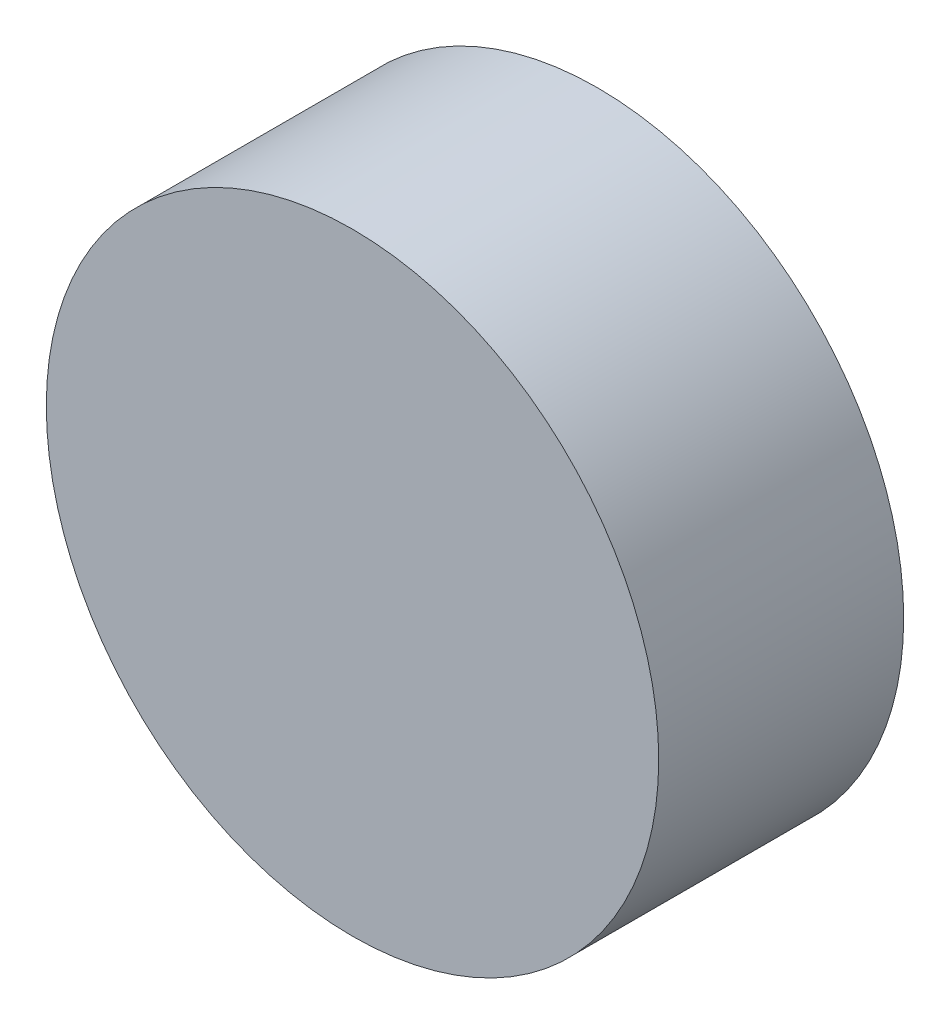
ISO-10303-21;
HEADER;
FILE_DESCRIPTION(('STEP AP214'),'2;1');
FILE_NAME('part.step','',(''),(''),'','','');
FILE_SCHEMA(('AUTOMOTIVE_DESIGN { 1 0 10303 214 1 1 1 1 }'));
ENDSEC;
DATA;
#1=APPLICATION_CONTEXT('core data for automotive mechanical design processes');
#2=APPLICATION_PROTOCOL_DEFINITION('international standard','automotive_design',2000,#1);
#3=PRODUCT_CONTEXT('',#1,'mechanical');
#4=PRODUCT('Part','Part','',(#3));
#5=PRODUCT_RELATED_PRODUCT_CATEGORY('part','',(#4));
#6=PRODUCT_DEFINITION_FORMATION('','',#4);
#7=PRODUCT_DEFINITION_CONTEXT('part definition',#1,'design');
#8=PRODUCT_DEFINITION('design','',#6,#7);
#9=PRODUCT_DEFINITION_SHAPE('','',#8);
#10=(LENGTH_UNIT() NAMED_UNIT(*) SI_UNIT(.MILLI.,.METRE.));
#11=(NAMED_UNIT(*) PLANE_ANGLE_UNIT() SI_UNIT($,.RADIAN.));
#12=(NAMED_UNIT(*) SI_UNIT($,.STERADIAN.) SOLID_ANGLE_UNIT());
#13=UNCERTAINTY_MEASURE_WITH_UNIT(LENGTH_MEASURE(1.E-05),#10,'distance_accuracy_value','');
#14=(GEOMETRIC_REPRESENTATION_CONTEXT(3) GLOBAL_UNCERTAINTY_ASSIGNED_CONTEXT((#13)) GLOBAL_UNIT_ASSIGNED_CONTEXT((#10,
#11,#12)) REPRESENTATION_CONTEXT('',''));
#15=CARTESIAN_POINT('',(0.,0.,0.));
#16=DIRECTION('',(0.,0.,1.));
#17=DIRECTION('',(1.,0.,0.));
#18=AXIS2_PLACEMENT_3D('',#15,#16,#17);
#19=CARTESIAN_POINT('',(0.,0.,2.));
#20=DIRECTION('',(0.,0.,-1.));
#21=DIRECTION('',(-1.,0.,0.));
#22=AXIS2_PLACEMENT_3D('',#19,#20,#21);
#23=CYLINDRICAL_SURFACE('',#22,2.5);
#24=CARTESIAN_POINT('',(0.,0.,2.));
#25=DIRECTION('',(0.,0.,1.));
#26=DIRECTION('',(1.,0.,0.));
#27=AXIS2_PLACEMENT_3D('',#24,#25,#26);
#28=CIRCLE('',#27,2.5);
#29=CARTESIAN_POINT('',(2.5,0.,2.));
#30=VERTEX_POINT('',#29);
#31=EDGE_CURVE('E10',#30,#30,#28,.T.);
#32=ORIENTED_EDGE('',*,*,#31,.F.);
#33=EDGE_LOOP('',(#32));
#34=FACE_BOUND('',#33,.T.);
#35=CARTESIAN_POINT('',(0.,0.,0.));
#36=DIRECTION('',(0.,0.,1.));
#37=DIRECTION('',(1.,0.,0.));
#38=AXIS2_PLACEMENT_3D('',#35,#36,#37);
#39=CIRCLE('',#38,2.5);
#40=CARTESIAN_POINT('',(2.5,0.,0.));
#41=VERTEX_POINT('',#40);
#42=EDGE_CURVE('E33',#41,#41,#39,.T.);
#43=ORIENTED_EDGE('',*,*,#42,.T.);
#44=EDGE_LOOP('',(#43));
#45=FACE_BOUND('',#44,.T.);
#46=ADVANCED_FACE('F30',(#34,#45),#23,.T.);
#47=CARTESIAN_POINT('',(0.,0.,2.));
#48=DIRECTION('',(0.,0.,1.));
#49=DIRECTION('',(1.,0.,0.));
#50=AXIS2_PLACEMENT_3D('',#47,#48,#49);
#51=PLANE('',#50);
#52=ORIENTED_EDGE('',*,*,#31,.T.);
#53=EDGE_LOOP('',(#52));
#54=FACE_BOUND('',#53,.T.);
#55=ADVANCED_FACE('F45',(#54),#51,.T.);
#56=CARTESIAN_POINT('',(0.,0.,0.));
#57=DIRECTION('',(0.,0.,1.));
#58=DIRECTION('',(1.,0.,0.));
#59=AXIS2_PLACEMENT_3D('',#56,#57,#58);
#60=PLANE('',#59);
#61=ORIENTED_EDGE('',*,*,#42,.F.);
#62=EDGE_LOOP('',(#61));
#63=FACE_BOUND('',#62,.T.);
#64=ADVANCED_FACE('F43',(#63),#60,.F.);
#65=CLOSED_SHELL('',(#46,#55,#64));
#66=MANIFOLD_SOLID_BREP('B2',#65);
#67=ADVANCED_BREP_SHAPE_REPRESENTATION('',(#18,#66),#14);
#68=SHAPE_DEFINITION_REPRESENTATION(#9,#67);
ENDSEC;
END-ISO-10303-21;
